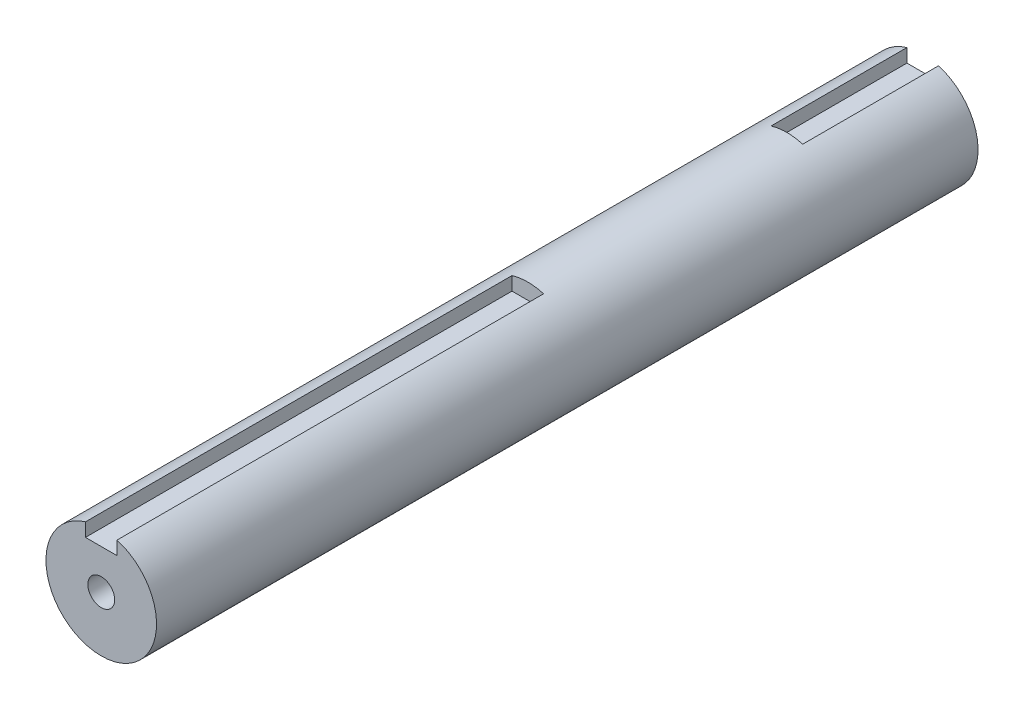
ISO-10303-21;
HEADER;
FILE_DESCRIPTION(('STEP AP214'),'2;1');
FILE_NAME('part.step','',(''),(''),'','','');
FILE_SCHEMA(('AUTOMOTIVE_DESIGN { 1 0 10303 214 1 1 1 1 }'));
ENDSEC;
DATA;
#1=APPLICATION_CONTEXT('core data for automotive mechanical design processes');
#2=APPLICATION_PROTOCOL_DEFINITION('international standard','automotive_design',2000,#1);
#3=PRODUCT_CONTEXT('',#1,'mechanical');
#4=PRODUCT('Part','Part','',(#3));
#5=PRODUCT_RELATED_PRODUCT_CATEGORY('part','',(#4));
#6=PRODUCT_DEFINITION_FORMATION('','',#4);
#7=PRODUCT_DEFINITION_CONTEXT('part definition',#1,'design');
#8=PRODUCT_DEFINITION('design','',#6,#7);
#9=PRODUCT_DEFINITION_SHAPE('','',#8);
#10=(LENGTH_UNIT() NAMED_UNIT(*) SI_UNIT(.MILLI.,.METRE.));
#11=(NAMED_UNIT(*) PLANE_ANGLE_UNIT() SI_UNIT($,.RADIAN.));
#12=(NAMED_UNIT(*) SI_UNIT($,.STERADIAN.) SOLID_ANGLE_UNIT());
#13=UNCERTAINTY_MEASURE_WITH_UNIT(LENGTH_MEASURE(1.E-05),#10,'distance_accuracy_value','');
#14=(GEOMETRIC_REPRESENTATION_CONTEXT(3) GLOBAL_UNCERTAINTY_ASSIGNED_CONTEXT((#13)) GLOBAL_UNIT_ASSIGNED_CONTEXT((#10,
#11,#12)) REPRESENTATION_CONTEXT('',''));
#15=CARTESIAN_POINT('',(0.,0.,0.));
#16=DIRECTION('',(0.,0.,1.));
#17=DIRECTION('',(1.,0.,0.));
#18=AXIS2_PLACEMENT_3D('',#15,#16,#17);
#19=CARTESIAN_POINT('',(0.,0.,260.));
#20=DIRECTION('',(0.,0.,-1.));
#21=DIRECTION('',(-1.,0.,0.));
#22=AXIS2_PLACEMENT_3D('',#19,#20,#21);
#23=CYLINDRICAL_SURFACE('',#22,17.5);
#24=CARTESIAN_POINT('',(0.,0.,0.));
#25=DIRECTION('',(0.,0.,1.));
#26=DIRECTION('',(1.,0.,0.));
#27=AXIS2_PLACEMENT_3D('',#24,#25,#26);
#28=CIRCLE('',#27,17.5);
#29=CARTESIAN_POINT('',(-5.,16.7705098312484,0.));
#30=VERTEX_POINT('',#29);
#31=CARTESIAN_POINT('',(5.,16.7705098312484,0.));
#32=VERTEX_POINT('',#31);
#33=EDGE_CURVE('E162',#30,#32,#28,.T.);
#34=ORIENTED_EDGE('',*,*,#33,.T.);
#35=DIRECTION('',(0.,0.,-1.));
#36=VECTOR('',#35,1.);
#37=CARTESIAN_POINT('',(5.,16.7705098312484,260.));
#38=LINE('',#37,#36);
#39=CARTESIAN_POINT('',(5.,16.7705098312484,43.));
#40=VERTEX_POINT('',#39);
#41=EDGE_CURVE('E138',#32,#40,#38,.F.);
#42=ORIENTED_EDGE('',*,*,#41,.T.);
#43=CARTESIAN_POINT('',(0.,0.,43.));
#44=DIRECTION('',(0.,0.,-1.));
#45=DIRECTION('',(-1.,0.,0.));
#46=AXIS2_PLACEMENT_3D('',#43,#44,#45);
#47=CIRCLE('',#46,17.5);
#48=CARTESIAN_POINT('',(-5.,16.7705098312484,43.));
#49=VERTEX_POINT('',#48);
#50=EDGE_CURVE('E11',#49,#40,#47,.T.);
#51=ORIENTED_EDGE('',*,*,#50,.F.);
#52=DIRECTION('',(0.,0.,-1.));
#53=VECTOR('',#52,1.);
#54=CARTESIAN_POINT('',(-5.,16.7705098312484,260.));
#55=LINE('',#54,#53);
#56=EDGE_CURVE('E134',#49,#30,#55,.T.);
#57=ORIENTED_EDGE('',*,*,#56,.T.);
#58=EDGE_LOOP('',(#34,#42,#51,#57));
#59=FACE_BOUND('',#58,.T.);
#60=CARTESIAN_POINT('',(0.,0.,260.));
#61=DIRECTION('',(0.,0.,1.));
#62=DIRECTION('',(1.,0.,0.));
#63=AXIS2_PLACEMENT_3D('',#60,#61,#62);
#64=CIRCLE('',#63,17.5);
#65=CARTESIAN_POINT('',(-5.,16.7705098312484,260.));
#66=VERTEX_POINT('',#65);
#67=CARTESIAN_POINT('',(5.,16.7705098312484,260.));
#68=VERTEX_POINT('',#67);
#69=EDGE_CURVE('E163',#66,#68,#64,.T.);
#70=ORIENTED_EDGE('',*,*,#69,.F.);
#71=DIRECTION('',(0.,0.,-1.));
#72=VECTOR('',#71,1.);
#73=CARTESIAN_POINT('',(-5.,16.7705098312484,260.));
#74=LINE('',#73,#72);
#75=CARTESIAN_POINT('',(-5.,16.7705098312484,125.));
#76=VERTEX_POINT('',#75);
#77=EDGE_CURVE('E159',#66,#76,#74,.T.);
#78=ORIENTED_EDGE('',*,*,#77,.T.);
#79=CARTESIAN_POINT('',(0.,0.,125.));
#80=DIRECTION('',(0.,0.,1.));
#81=DIRECTION('',(1.,0.,0.));
#82=AXIS2_PLACEMENT_3D('',#79,#80,#81);
#83=CIRCLE('',#82,17.5);
#84=CARTESIAN_POINT('',(5.,16.7705098312484,125.));
#85=VERTEX_POINT('',#84);
#86=EDGE_CURVE('E170',#85,#76,#83,.T.);
#87=ORIENTED_EDGE('',*,*,#86,.F.);
#88=DIRECTION('',(0.,0.,-1.));
#89=VECTOR('',#88,1.);
#90=CARTESIAN_POINT('',(5.,16.7705098312484,260.));
#91=LINE('',#90,#89);
#92=EDGE_CURVE('E155',#85,#68,#91,.F.);
#93=ORIENTED_EDGE('',*,*,#92,.T.);
#94=EDGE_LOOP('',(#70,#78,#87,#93));
#95=FACE_BOUND('',#94,.T.);
#96=ADVANCED_FACE('F37',(#59,#95),#23,.T.);
#97=CARTESIAN_POINT('',(0.,0.,260.));
#98=DIRECTION('',(0.,0.,1.));
#99=DIRECTION('',(1.,0.,0.));
#100=AXIS2_PLACEMENT_3D('',#97,#98,#99);
#101=PLANE('',#100);
#102=CARTESIAN_POINT('',(0.,0.,260.));
#103=DIRECTION('',(0.,0.,1.));
#104=DIRECTION('',(1.,0.,0.));
#105=AXIS2_PLACEMENT_3D('',#102,#103,#104);
#106=CIRCLE('',#105,4.24999999999999);
#107=CARTESIAN_POINT('',(4.24999999999999,0.,260.));
#108=VERTEX_POINT('',#107);
#109=EDGE_CURVE('E116',#108,#108,#106,.T.);
#110=ORIENTED_EDGE('',*,*,#109,.F.);
#111=EDGE_LOOP('',(#110));
#112=FACE_BOUND('',#111,.T.);
#113=DIRECTION('',(0.,-1.,0.));
#114=VECTOR('',#113,1.);
#115=CARTESIAN_POINT('',(-4.99999999999999,0.,260.));
#116=LINE('',#115,#114);
#117=CARTESIAN_POINT('',(-5.,12.5,260.));
#118=VERTEX_POINT('',#117);
#119=EDGE_CURVE('E166',#66,#118,#116,.T.);
#120=ORIENTED_EDGE('',*,*,#119,.F.);
#121=ORIENTED_EDGE('',*,*,#69,.T.);
#122=DIRECTION('',(0.,1.,0.));
#123=VECTOR('',#122,1.);
#124=CARTESIAN_POINT('',(5.,18.1341331634652,260.));
#125=LINE('',#124,#123);
#126=CARTESIAN_POINT('',(5.,12.5,260.));
#127=VERTEX_POINT('',#126);
#128=EDGE_CURVE('E145',#127,#68,#125,.T.);
#129=ORIENTED_EDGE('',*,*,#128,.F.);
#130=DIRECTION('',(1.,0.,0.));
#131=VECTOR('',#130,1.);
#132=CARTESIAN_POINT('',(-5.,12.5,260.));
#133=LINE('',#132,#131);
#134=EDGE_CURVE('E141',#118,#127,#133,.T.);
#135=ORIENTED_EDGE('',*,*,#134,.F.);
#136=EDGE_LOOP('',(#120,#121,#129,#135));
#137=FACE_BOUND('',#136,.T.);
#138=ADVANCED_FACE('F196',(#112,#137),#101,.T.);
#139=CARTESIAN_POINT('',(0.,0.,0.));
#140=DIRECTION('',(0.,0.,1.));
#141=DIRECTION('',(1.,0.,0.));
#142=AXIS2_PLACEMENT_3D('',#139,#140,#141);
#143=PLANE('',#142);
#144=DIRECTION('',(-1.,0.,0.));
#145=VECTOR('',#144,1.);
#146=CARTESIAN_POINT('',(5.,12.5,0.));
#147=LINE('',#146,#145);
#148=CARTESIAN_POINT('',(5.,12.5,0.));
#149=VERTEX_POINT('',#148);
#150=CARTESIAN_POINT('',(-5.,12.5,0.));
#151=VERTEX_POINT('',#150);
#152=EDGE_CURVE('E115',#149,#151,#147,.T.);
#153=ORIENTED_EDGE('',*,*,#152,.F.);
#154=DIRECTION('',(0.,1.,0.));
#155=VECTOR('',#154,1.);
#156=CARTESIAN_POINT('',(5.,0.,0.));
#157=LINE('',#156,#155);
#158=EDGE_CURVE('E44',#149,#32,#157,.T.);
#159=ORIENTED_EDGE('',*,*,#158,.T.);
#160=ORIENTED_EDGE('',*,*,#33,.F.);
#161=DIRECTION('',(0.,1.,0.));
#162=VECTOR('',#161,1.);
#163=CARTESIAN_POINT('',(-5.,18.467992577476,0.));
#164=LINE('',#163,#162);
#165=EDGE_CURVE('E118',#151,#30,#164,.T.);
#166=ORIENTED_EDGE('',*,*,#165,.F.);
#167=EDGE_LOOP('',(#153,#159,#160,#166));
#168=FACE_BOUND('',#167,.T.);
#169=ADVANCED_FACE('F175',(#168),#143,.F.);
#170=CARTESIAN_POINT('',(0.,0.,125.));
#171=DIRECTION('',(0.,0.,1.));
#172=DIRECTION('',(1.,0.,0.));
#173=AXIS2_PLACEMENT_3D('',#170,#171,#172);
#174=PLANE('',#173);
#175=ORIENTED_EDGE('',*,*,#86,.T.);
#176=DIRECTION('',(0.,-1.,0.));
#177=VECTOR('',#176,1.);
#178=CARTESIAN_POINT('',(-5.,18.1341331634652,125.));
#179=LINE('',#178,#177);
#180=CARTESIAN_POINT('',(-5.,12.5,125.));
#181=VERTEX_POINT('',#180);
#182=EDGE_CURVE('E142',#76,#181,#179,.T.);
#183=ORIENTED_EDGE('',*,*,#182,.T.);
#184=DIRECTION('',(1.,0.,0.));
#185=VECTOR('',#184,1.);
#186=CARTESIAN_POINT('',(-5.,12.5,125.));
#187=LINE('',#186,#185);
#188=CARTESIAN_POINT('',(5.,12.5,125.));
#189=VERTEX_POINT('',#188);
#190=EDGE_CURVE('E144',#181,#189,#187,.T.);
#191=ORIENTED_EDGE('',*,*,#190,.T.);
#192=DIRECTION('',(0.,1.,0.));
#193=VECTOR('',#192,1.);
#194=CARTESIAN_POINT('',(5.,18.1341331634652,125.));
#195=LINE('',#194,#193);
#196=EDGE_CURVE('E148',#189,#85,#195,.T.);
#197=ORIENTED_EDGE('',*,*,#196,.T.);
#198=EDGE_LOOP('',(#175,#183,#191,#197));
#199=FACE_BOUND('',#198,.T.);
#200=ADVANCED_FACE('F205',(#199),#174,.T.);
#201=CARTESIAN_POINT('',(-5.,18.1341331634652,125.));
#202=DIRECTION('',(-1.,0.,0.));
#203=DIRECTION('',(0.,-1.,0.));
#204=AXIS2_PLACEMENT_3D('',#201,#202,#203);
#205=PLANE('',#204);
#206=ORIENTED_EDGE('',*,*,#119,.T.);
#207=DIRECTION('',(0.,0.,1.));
#208=VECTOR('',#207,1.);
#209=CARTESIAN_POINT('',(-5.,12.5,125.));
#210=LINE('',#209,#208);
#211=EDGE_CURVE('E59',#181,#118,#210,.T.);
#212=ORIENTED_EDGE('',*,*,#211,.F.);
#213=ORIENTED_EDGE('',*,*,#182,.F.);
#214=ORIENTED_EDGE('',*,*,#77,.F.);
#215=EDGE_LOOP('',(#206,#212,#213,#214));
#216=FACE_BOUND('',#215,.T.);
#217=ADVANCED_FACE('F209',(#216),#205,.F.);
#218=CARTESIAN_POINT('',(5.,18.1341331634652,125.));
#219=DIRECTION('',(1.,0.,0.));
#220=DIRECTION('',(0.,1.,0.));
#221=AXIS2_PLACEMENT_3D('',#218,#219,#220);
#222=PLANE('',#221);
#223=ORIENTED_EDGE('',*,*,#196,.F.);
#224=DIRECTION('',(0.,0.,1.));
#225=VECTOR('',#224,1.);
#226=CARTESIAN_POINT('',(5.,12.5,125.));
#227=LINE('',#226,#225);
#228=EDGE_CURVE('E153',#189,#127,#227,.T.);
#229=ORIENTED_EDGE('',*,*,#228,.T.);
#230=ORIENTED_EDGE('',*,*,#128,.T.);
#231=ORIENTED_EDGE('',*,*,#92,.F.);
#232=EDGE_LOOP('',(#223,#229,#230,#231));
#233=FACE_BOUND('',#232,.T.);
#234=ADVANCED_FACE('F212',(#233),#222,.F.);
#235=CARTESIAN_POINT('',(-5.,12.5,125.));
#236=DIRECTION('',(0.,-1.,0.));
#237=DIRECTION('',(0.,0.,-1.));
#238=AXIS2_PLACEMENT_3D('',#235,#236,#237);
#239=PLANE('',#238);
#240=ORIENTED_EDGE('',*,*,#134,.T.);
#241=ORIENTED_EDGE('',*,*,#228,.F.);
#242=ORIENTED_EDGE('',*,*,#190,.F.);
#243=ORIENTED_EDGE('',*,*,#211,.T.);
#244=EDGE_LOOP('',(#240,#241,#242,#243));
#245=FACE_BOUND('',#244,.T.);
#246=ADVANCED_FACE('F214',(#245),#239,.F.);
#247=CARTESIAN_POINT('',(0.,0.,43.));
#248=DIRECTION('',(0.,0.,-1.));
#249=DIRECTION('',(-1.,0.,0.));
#250=AXIS2_PLACEMENT_3D('',#247,#248,#249);
#251=PLANE('',#250);
#252=ORIENTED_EDGE('',*,*,#50,.T.);
#253=DIRECTION('',(0.,-1.,0.));
#254=VECTOR('',#253,1.);
#255=CARTESIAN_POINT('',(5.,18.467992577476,43.));
#256=LINE('',#255,#254);
#257=CARTESIAN_POINT('',(5.,12.5,43.));
#258=VERTEX_POINT('',#257);
#259=EDGE_CURVE('E123',#40,#258,#256,.T.);
#260=ORIENTED_EDGE('',*,*,#259,.T.);
#261=DIRECTION('',(-1.,0.,0.));
#262=VECTOR('',#261,1.);
#263=CARTESIAN_POINT('',(5.,12.5,43.));
#264=LINE('',#263,#262);
#265=CARTESIAN_POINT('',(-5.,12.5,43.));
#266=VERTEX_POINT('',#265);
#267=EDGE_CURVE('E125',#258,#266,#264,.T.);
#268=ORIENTED_EDGE('',*,*,#267,.T.);
#269=DIRECTION('',(0.,1.,0.));
#270=VECTOR('',#269,1.);
#271=CARTESIAN_POINT('',(-5.,18.467992577476,43.));
#272=LINE('',#271,#270);
#273=EDGE_CURVE('E128',#266,#49,#272,.T.);
#274=ORIENTED_EDGE('',*,*,#273,.T.);
#275=EDGE_LOOP('',(#252,#260,#268,#274));
#276=FACE_BOUND('',#275,.T.);
#277=ADVANCED_FACE('F185',(#276),#251,.T.);
#278=CARTESIAN_POINT('',(5.,18.467992577476,43.));
#279=DIRECTION('',(1.,0.,0.));
#280=DIRECTION('',(0.,1.,0.));
#281=AXIS2_PLACEMENT_3D('',#278,#279,#280);
#282=PLANE('',#281);
#283=ORIENTED_EDGE('',*,*,#158,.F.);
#284=DIRECTION('',(0.,0.,-1.));
#285=VECTOR('',#284,1.);
#286=CARTESIAN_POINT('',(5.,12.5,43.));
#287=LINE('',#286,#285);
#288=EDGE_CURVE('E51',#258,#149,#287,.T.);
#289=ORIENTED_EDGE('',*,*,#288,.F.);
#290=ORIENTED_EDGE('',*,*,#259,.F.);
#291=ORIENTED_EDGE('',*,*,#41,.F.);
#292=EDGE_LOOP('',(#283,#289,#290,#291));
#293=FACE_BOUND('',#292,.T.);
#294=ADVANCED_FACE('F192',(#293),#282,.F.);
#295=CARTESIAN_POINT('',(-5.,18.467992577476,43.));
#296=DIRECTION('',(-1.,0.,0.));
#297=DIRECTION('',(0.,-1.,0.));
#298=AXIS2_PLACEMENT_3D('',#295,#296,#297);
#299=PLANE('',#298);
#300=ORIENTED_EDGE('',*,*,#273,.F.);
#301=DIRECTION('',(0.,0.,-1.));
#302=VECTOR('',#301,1.);
#303=CARTESIAN_POINT('',(-5.,12.5,43.));
#304=LINE('',#303,#302);
#305=EDGE_CURVE('E132',#266,#151,#304,.T.);
#306=ORIENTED_EDGE('',*,*,#305,.T.);
#307=ORIENTED_EDGE('',*,*,#165,.T.);
#308=ORIENTED_EDGE('',*,*,#56,.F.);
#309=EDGE_LOOP('',(#300,#306,#307,#308));
#310=FACE_BOUND('',#309,.T.);
#311=ADVANCED_FACE('F183',(#310),#299,.F.);
#312=CARTESIAN_POINT('',(5.,12.5,43.));
#313=DIRECTION('',(0.,-1.,0.));
#314=DIRECTION('',(0.,0.,-1.));
#315=AXIS2_PLACEMENT_3D('',#312,#313,#314);
#316=PLANE('',#315);
#317=ORIENTED_EDGE('',*,*,#152,.T.);
#318=ORIENTED_EDGE('',*,*,#305,.F.);
#319=ORIENTED_EDGE('',*,*,#267,.F.);
#320=ORIENTED_EDGE('',*,*,#288,.T.);
#321=EDGE_LOOP('',(#317,#318,#319,#320));
#322=FACE_BOUND('',#321,.T.);
#323=ADVANCED_FACE('F109',(#322),#316,.F.);
#324=CARTESIAN_POINT('',(0.,0.,214.));
#325=DIRECTION('',(0.,0.,1.));
#326=DIRECTION('',(1.,0.,0.));
#327=AXIS2_PLACEMENT_3D('',#324,#325,#326);
#328=CONICAL_SURFACE('',#327,4.24999999999998,1.02974425867665);
#329=CARTESIAN_POINT('',(0.,0.,211.446342369133));
#330=VERTEX_POINT('',#329);
#331=VERTEX_LOOP('',#330);
#332=FACE_BOUND('',#331,.T.);
#333=CARTESIAN_POINT('',(0.,0.,214.));
#334=DIRECTION('',(0.,0.,1.));
#335=DIRECTION('',(1.,0.,0.));
#336=AXIS2_PLACEMENT_3D('',#333,#334,#335);
#337=CIRCLE('',#336,4.24999999999998);
#338=CARTESIAN_POINT('',(4.24999999999998,0.,214.));
#339=VERTEX_POINT('',#338);
#340=EDGE_CURVE('E113',#339,#339,#337,.T.);
#341=ORIENTED_EDGE('',*,*,#340,.T.);
#342=EDGE_LOOP('',(#341));
#343=FACE_BOUND('',#342,.T.);
#344=ADVANCED_FACE('F105',(#332,#343),#328,.F.);
#345=CARTESIAN_POINT('',(0.,0.,260.));
#346=DIRECTION('',(0.,0.,1.));
#347=DIRECTION('',(1.,0.,0.));
#348=AXIS2_PLACEMENT_3D('',#345,#346,#347);
#349=CYLINDRICAL_SURFACE('',#348,4.24999999999999);
#350=ORIENTED_EDGE('',*,*,#340,.F.);
#351=EDGE_LOOP('',(#350));
#352=FACE_BOUND('',#351,.T.);
#353=ORIENTED_EDGE('',*,*,#109,.T.);
#354=EDGE_LOOP('',(#353));
#355=FACE_BOUND('',#354,.T.);
#356=ADVANCED_FACE('F108',(#352,#355),#349,.F.);
#357=CLOSED_SHELL('',(#96,#138,#169,#200,#217,#234,#246,#277,#294,#311,#323,#344,#356));
#358=MANIFOLD_SOLID_BREP('B2',#357);
#359=ADVANCED_BREP_SHAPE_REPRESENTATION('',(#18,#358),#14);
#360=SHAPE_DEFINITION_REPRESENTATION(#9,#359);
ENDSEC;
END-ISO-10303-21;
